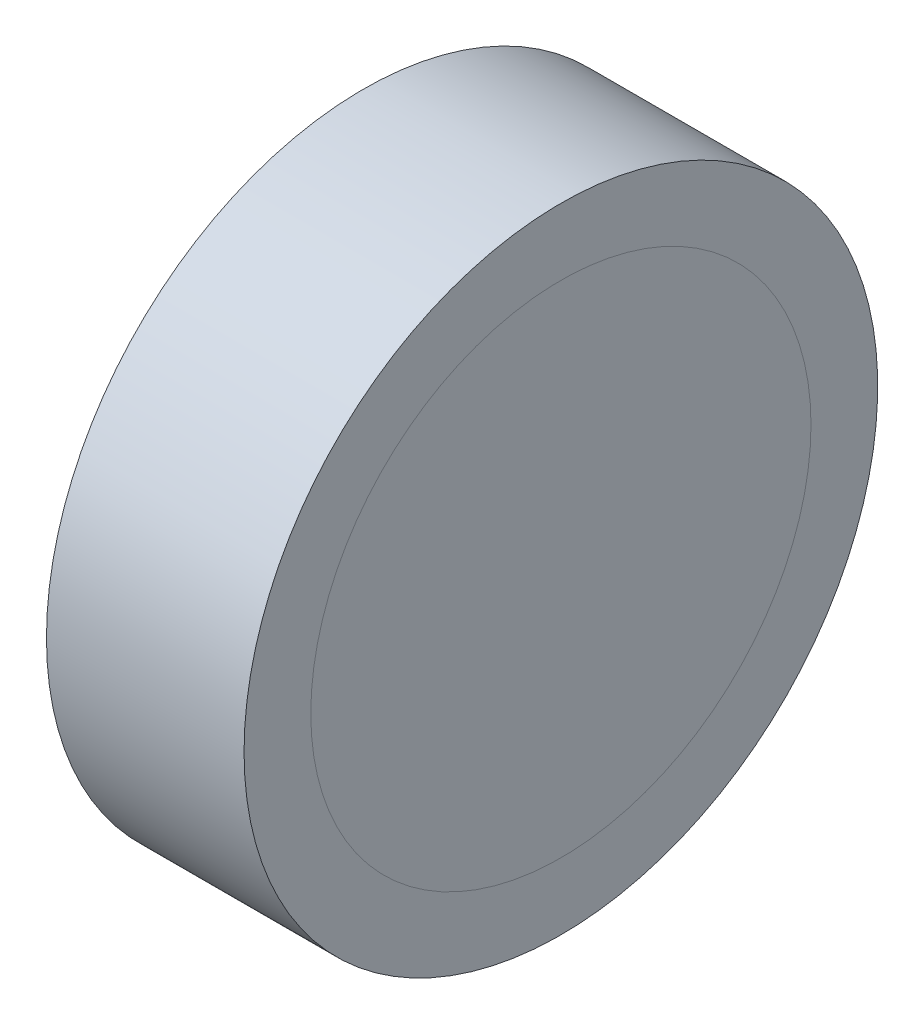
ISO-10303-21;
HEADER;
FILE_DESCRIPTION(('STEP AP214'),'2;1');
FILE_NAME('part.step','',(''),(''),'','','');
FILE_SCHEMA(('AUTOMOTIVE_DESIGN { 1 0 10303 214 1 1 1 1 }'));
ENDSEC;
DATA;
#1=APPLICATION_CONTEXT('core data for automotive mechanical design processes');
#2=APPLICATION_PROTOCOL_DEFINITION('international standard','automotive_design',2000,#1);
#3=PRODUCT_CONTEXT('',#1,'mechanical');
#4=PRODUCT('Part','Part','',(#3));
#5=PRODUCT_RELATED_PRODUCT_CATEGORY('part','',(#4));
#6=PRODUCT_DEFINITION_FORMATION('','',#4);
#7=PRODUCT_DEFINITION_CONTEXT('part definition',#1,'design');
#8=PRODUCT_DEFINITION('design','',#6,#7);
#9=PRODUCT_DEFINITION_SHAPE('','',#8);
#10=(LENGTH_UNIT() NAMED_UNIT(*) SI_UNIT(.MILLI.,.METRE.));
#11=(NAMED_UNIT(*) PLANE_ANGLE_UNIT() SI_UNIT($,.RADIAN.));
#12=(NAMED_UNIT(*) SI_UNIT($,.STERADIAN.) SOLID_ANGLE_UNIT());
#13=UNCERTAINTY_MEASURE_WITH_UNIT(LENGTH_MEASURE(1.E-05),#10,'distance_accuracy_value','');
#14=(GEOMETRIC_REPRESENTATION_CONTEXT(3) GLOBAL_UNCERTAINTY_ASSIGNED_CONTEXT((#13)) GLOBAL_UNIT_ASSIGNED_CONTEXT((#10,
#11,#12)) REPRESENTATION_CONTEXT('',''));
#15=CARTESIAN_POINT('',(0.,0.,0.));
#16=DIRECTION('',(0.,0.,1.));
#17=DIRECTION('',(1.,0.,0.));
#18=AXIS2_PLACEMENT_3D('',#15,#16,#17);
#19=CARTESIAN_POINT('',(301.404713074135,3.33791972254807E-12,0.));
#20=DIRECTION('',(1.,0.,0.));
#21=DIRECTION('',(0.,0.,-1.));
#22=AXIS2_PLACEMENT_3D('',#19,#20,#21);
#23=PLANE('',#22);
#24=CARTESIAN_POINT('',(301.404713074135,62.874237467185,0.));
#25=DIRECTION('',(-1.,0.,0.));
#26=DIRECTION('',(0.,0.,1.));
#27=AXIS2_PLACEMENT_3D('',#24,#25,#26);
#28=CIRCLE('',#27,10.025);
#29=CARTESIAN_POINT('',(301.404713074135,62.874237467185,10.025));
#30=VERTEX_POINT('',#29);
#31=EDGE_CURVE('E50',#30,#30,#28,.T.);
#32=ORIENTED_EDGE('',*,*,#31,.T.);
#33=EDGE_LOOP('',(#32));
#34=FACE_BOUND('',#33,.T.);
#35=ADVANCED_FACE('F44',(#34),#23,.F.);
#36=CARTESIAN_POINT('',(302.404713074135,0.,0.));
#37=DIRECTION('',(1.,0.,0.));
#38=DIRECTION('',(0.,0.,-1.));
#39=AXIS2_PLACEMENT_3D('',#36,#37,#38);
#40=PLANE('',#39);
#41=CARTESIAN_POINT('',(302.404713074135,62.874237467185,0.));
#42=DIRECTION('',(-1.,0.,0.));
#43=DIRECTION('',(0.,0.,1.));
#44=AXIS2_PLACEMENT_3D('',#41,#42,#43);
#45=CIRCLE('',#44,10.025);
#46=CARTESIAN_POINT('',(302.404713074135,62.874237467185,10.025));
#47=VERTEX_POINT('',#46);
#48=EDGE_CURVE('E11',#47,#47,#45,.T.);
#49=ORIENTED_EDGE('',*,*,#48,.F.);
#50=EDGE_LOOP('',(#49));
#51=FACE_BOUND('',#50,.T.);
#52=ADVANCED_FACE('F59',(#51),#40,.T.);
#53=CARTESIAN_POINT('',(286.622526245198,62.874237467185,0.));
#54=DIRECTION('',(-1.,0.,0.));
#55=DIRECTION('',(0.,0.,1.));
#56=AXIS2_PLACEMENT_3D('',#53,#54,#55);
#57=CYLINDRICAL_SURFACE('',#56,10.025);
#58=ORIENTED_EDGE('',*,*,#48,.T.);
#59=EDGE_LOOP('',(#58));
#60=FACE_BOUND('',#59,.T.);
#61=ORIENTED_EDGE('',*,*,#31,.F.);
#62=EDGE_LOOP('',(#61));
#63=FACE_BOUND('',#62,.T.);
#64=ADVANCED_FACE('F57',(#60,#63),#57,.T.);
#65=CLOSED_SHELL('',(#35,#52,#64));
#66=MANIFOLD_SOLID_BREP('B2',#65);
#67=CARTESIAN_POINT('',(294.484713074135,0.,0.));
#68=DIRECTION('',(1.,0.,0.));
#69=DIRECTION('',(0.,0.,-1.));
#70=AXIS2_PLACEMENT_3D('',#67,#68,#69);
#71=PLANE('',#70);
#72=CARTESIAN_POINT('',(294.484713074135,62.874237467185,0.));
#73=DIRECTION('',(-1.,0.,0.));
#74=DIRECTION('',(0.,0.,1.));
#75=AXIS2_PLACEMENT_3D('',#72,#73,#74);
#76=CIRCLE('',#75,10.025);
#77=CARTESIAN_POINT('',(294.484713074135,62.874237467185,10.025));
#78=VERTEX_POINT('',#77);
#79=EDGE_CURVE('E98',#78,#78,#76,.T.);
#80=ORIENTED_EDGE('',*,*,#79,.T.);
#81=EDGE_LOOP('',(#80));
#82=FACE_BOUND('',#81,.T.);
#83=ADVANCED_FACE('F92',(#82),#71,.F.);
#84=CARTESIAN_POINT('',(295.484713074135,2.45426881705483E-12,0.));
#85=DIRECTION('',(1.,0.,0.));
#86=DIRECTION('',(0.,0.,-1.));
#87=AXIS2_PLACEMENT_3D('',#84,#85,#86);
#88=PLANE('',#87);
#89=CARTESIAN_POINT('',(295.484713074135,62.874237467185,0.));
#90=DIRECTION('',(-1.,0.,0.));
#91=DIRECTION('',(0.,0.,1.));
#92=AXIS2_PLACEMENT_3D('',#89,#90,#91);
#93=CIRCLE('',#92,10.025);
#94=CARTESIAN_POINT('',(295.484713074135,62.874237467185,10.025));
#95=VERTEX_POINT('',#94);
#96=EDGE_CURVE('E43',#95,#95,#93,.T.);
#97=ORIENTED_EDGE('',*,*,#96,.F.);
#98=EDGE_LOOP('',(#97));
#99=FACE_BOUND('',#98,.T.);
#100=ADVANCED_FACE('F107',(#99),#88,.T.);
#101=CARTESIAN_POINT('',(286.622526245198,62.874237467185,0.));
#102=DIRECTION('',(-1.,0.,0.));
#103=DIRECTION('',(0.,0.,1.));
#104=AXIS2_PLACEMENT_3D('',#101,#102,#103);
#105=CYLINDRICAL_SURFACE('',#104,10.025);
#106=ORIENTED_EDGE('',*,*,#96,.T.);
#107=EDGE_LOOP('',(#106));
#108=FACE_BOUND('',#107,.T.);
#109=ORIENTED_EDGE('',*,*,#79,.F.);
#110=EDGE_LOOP('',(#109));
#111=FACE_BOUND('',#110,.T.);
#112=ADVANCED_FACE('F105',(#108,#111),#105,.T.);
#113=CLOSED_SHELL('',(#83,#100,#112));
#114=MANIFOLD_SOLID_BREP('B6',#113);
#115=CARTESIAN_POINT('',(295.484713074135,2.45426881705483E-12,0.));
#116=DIRECTION('',(1.,0.,0.));
#117=DIRECTION('',(0.,0.,-1.));
#118=AXIS2_PLACEMENT_3D('',#115,#116,#117);
#119=PLANE('',#118);
#120=CARTESIAN_POINT('',(295.484713074135,62.874237467185,0.));
#121=DIRECTION('',(-1.,0.,0.));
#122=DIRECTION('',(0.,0.,1.));
#123=AXIS2_PLACEMENT_3D('',#120,#121,#122);
#124=CIRCLE('',#123,7.55);
#125=CARTESIAN_POINT('',(295.484713074135,62.874237467185,7.55));
#126=VERTEX_POINT('',#125);
#127=EDGE_CURVE('E91',#126,#126,#124,.T.);
#128=ORIENTED_EDGE('',*,*,#127,.F.);
#129=EDGE_LOOP('',(#128));
#130=FACE_BOUND('',#129,.T.);
#131=CARTESIAN_POINT('',(295.484713074135,62.874237467185,0.));
#132=DIRECTION('',(-1.,0.,0.));
#133=DIRECTION('',(0.,0.,1.));
#134=AXIS2_PLACEMENT_3D('',#131,#132,#133);
#135=CIRCLE('',#134,10.025);
#136=CARTESIAN_POINT('',(295.484713074135,62.874237467185,10.025));
#137=VERTEX_POINT('',#136);
#138=EDGE_CURVE('E161',#137,#137,#135,.T.);
#139=ORIENTED_EDGE('',*,*,#138,.T.);
#140=EDGE_LOOP('',(#139));
#141=FACE_BOUND('',#140,.T.);
#142=ADVANCED_FACE('F133',(#130,#141),#119,.F.);
#143=CARTESIAN_POINT('',(286.622526245198,62.874237467185,0.));
#144=DIRECTION('',(-1.,0.,0.));
#145=DIRECTION('',(0.,0.,1.));
#146=AXIS2_PLACEMENT_3D('',#143,#144,#145);
#147=CYLINDRICAL_SURFACE('',#146,7.55);
#148=CARTESIAN_POINT('',(301.404713074135,62.874237467185,0.));
#149=DIRECTION('',(-1.,0.,0.));
#150=DIRECTION('',(0.,0.,1.));
#151=AXIS2_PLACEMENT_3D('',#148,#149,#150);
#152=CIRCLE('',#151,7.55);
#153=CARTESIAN_POINT('',(301.404713074135,62.874237467185,7.55));
#154=VERTEX_POINT('',#153);
#155=EDGE_CURVE('E139',#154,#154,#152,.T.);
#156=ORIENTED_EDGE('',*,*,#155,.F.);
#157=EDGE_LOOP('',(#156));
#158=FACE_BOUND('',#157,.T.);
#159=ORIENTED_EDGE('',*,*,#127,.T.);
#160=EDGE_LOOP('',(#159));
#161=FACE_BOUND('',#160,.T.);
#162=ADVANCED_FACE('F190',(#158,#161),#147,.F.);
#163=CARTESIAN_POINT('',(301.404713074135,3.33791972254807E-12,0.));
#164=DIRECTION('',(1.,0.,0.));
#165=DIRECTION('',(0.,0.,-1.));
#166=AXIS2_PLACEMENT_3D('',#163,#164,#165);
#167=PLANE('',#166);
#168=ORIENTED_EDGE('',*,*,#155,.T.);
#169=EDGE_LOOP('',(#168));
#170=FACE_BOUND('',#169,.T.);
#171=CARTESIAN_POINT('',(301.404713074135,62.874237467185,0.));
#172=DIRECTION('',(-1.,0.,0.));
#173=DIRECTION('',(0.,0.,1.));
#174=AXIS2_PLACEMENT_3D('',#171,#172,#173);
#175=CIRCLE('',#174,10.025);
#176=CARTESIAN_POINT('',(301.404713074135,62.874237467185,10.025));
#177=VERTEX_POINT('',#176);
#178=EDGE_CURVE('E143',#177,#177,#175,.T.);
#179=ORIENTED_EDGE('',*,*,#178,.F.);
#180=EDGE_LOOP('',(#179));
#181=FACE_BOUND('',#180,.T.);
#182=ADVANCED_FACE('F195',(#170,#181),#167,.T.);
#183=CARTESIAN_POINT('',(286.622526245198,62.874237467185,0.));
#184=DIRECTION('',(-1.,0.,0.));
#185=DIRECTION('',(0.,0.,1.));
#186=AXIS2_PLACEMENT_3D('',#183,#184,#185);
#187=CYLINDRICAL_SURFACE('',#186,10.025);
#188=CARTESIAN_POINT('',(302.404713074135,62.874237467185,0.));
#189=DIRECTION('',(-1.,0.,0.));
#190=DIRECTION('',(0.,0.,1.));
#191=AXIS2_PLACEMENT_3D('',#188,#189,#190);
#192=CIRCLE('',#191,10.025);
#193=CARTESIAN_POINT('',(302.404713074135,62.874237467185,10.025));
#194=VERTEX_POINT('',#193);
#195=EDGE_CURVE('E147',#194,#194,#192,.T.);
#196=ORIENTED_EDGE('',*,*,#195,.F.);
#197=EDGE_LOOP('',(#196));
#198=FACE_BOUND('',#197,.T.);
#199=ORIENTED_EDGE('',*,*,#178,.T.);
#200=EDGE_LOOP('',(#199));
#201=FACE_BOUND('',#200,.T.);
#202=ADVANCED_FACE('F186',(#198,#201),#187,.F.);
#203=CARTESIAN_POINT('',(302.404713074135,0.,0.));
#204=DIRECTION('',(1.,0.,0.));
#205=DIRECTION('',(0.,0.,-1.));
#206=AXIS2_PLACEMENT_3D('',#203,#204,#205);
#207=PLANE('',#206);
#208=ORIENTED_EDGE('',*,*,#195,.T.);
#209=EDGE_LOOP('',(#208));
#210=FACE_BOUND('',#209,.T.);
#211=CARTESIAN_POINT('',(302.404713074135,62.874237467185,0.));
#212=DIRECTION('',(-1.,0.,0.));
#213=DIRECTION('',(0.,0.,1.));
#214=AXIS2_PLACEMENT_3D('',#211,#212,#213);
#215=CIRCLE('',#214,12.7);
#216=CARTESIAN_POINT('',(302.404713074135,62.874237467185,12.7));
#217=VERTEX_POINT('',#216);
#218=EDGE_CURVE('E152',#217,#217,#215,.T.);
#219=ORIENTED_EDGE('',*,*,#218,.F.);
#220=EDGE_LOOP('',(#219));
#221=FACE_BOUND('',#220,.T.);
#222=ADVANCED_FACE('F180',(#210,#221),#207,.T.);
#223=CARTESIAN_POINT('',(286.622526245198,62.874237467185,0.));
#224=DIRECTION('',(-1.,0.,0.));
#225=DIRECTION('',(0.,0.,1.));
#226=AXIS2_PLACEMENT_3D('',#223,#224,#225);
#227=CYLINDRICAL_SURFACE('',#226,12.7);
#228=ORIENTED_EDGE('',*,*,#218,.T.);
#229=EDGE_LOOP('',(#228));
#230=FACE_BOUND('',#229,.T.);
#231=CARTESIAN_POINT('',(294.484713074135,62.874237467185,0.));
#232=DIRECTION('',(-1.,0.,0.));
#233=DIRECTION('',(0.,0.,1.));
#234=AXIS2_PLACEMENT_3D('',#231,#232,#233);
#235=CIRCLE('',#234,12.7);
#236=CARTESIAN_POINT('',(294.484713074135,62.874237467185,12.7));
#237=VERTEX_POINT('',#236);
#238=EDGE_CURVE('E155',#237,#237,#235,.T.);
#239=ORIENTED_EDGE('',*,*,#238,.F.);
#240=EDGE_LOOP('',(#239));
#241=FACE_BOUND('',#240,.T.);
#242=ADVANCED_FACE('F175',(#230,#241),#227,.T.);
#243=CARTESIAN_POINT('',(294.484713074135,0.,0.));
#244=DIRECTION('',(1.,0.,0.));
#245=DIRECTION('',(0.,0.,-1.));
#246=AXIS2_PLACEMENT_3D('',#243,#244,#245);
#247=PLANE('',#246);
#248=CARTESIAN_POINT('',(294.484713074135,62.874237467185,0.));
#249=DIRECTION('',(-1.,0.,0.));
#250=DIRECTION('',(0.,0.,1.));
#251=AXIS2_PLACEMENT_3D('',#248,#249,#250);
#252=CIRCLE('',#251,10.025);
#253=CARTESIAN_POINT('',(294.484713074135,62.874237467185,10.025));
#254=VERTEX_POINT('',#253);
#255=EDGE_CURVE('E158',#254,#254,#252,.T.);
#256=ORIENTED_EDGE('',*,*,#255,.F.);
#257=EDGE_LOOP('',(#256));
#258=FACE_BOUND('',#257,.T.);
#259=ORIENTED_EDGE('',*,*,#238,.T.);
#260=EDGE_LOOP('',(#259));
#261=FACE_BOUND('',#260,.T.);
#262=ADVANCED_FACE('F169',(#258,#261),#247,.F.);
#263=CARTESIAN_POINT('',(286.622526245198,62.874237467185,0.));
#264=DIRECTION('',(-1.,0.,0.));
#265=DIRECTION('',(0.,0.,1.));
#266=AXIS2_PLACEMENT_3D('',#263,#264,#265);
#267=CYLINDRICAL_SURFACE('',#266,10.025);
#268=ORIENTED_EDGE('',*,*,#138,.F.);
#269=EDGE_LOOP('',(#268));
#270=FACE_BOUND('',#269,.T.);
#271=ORIENTED_EDGE('',*,*,#255,.T.);
#272=EDGE_LOOP('',(#271));
#273=FACE_BOUND('',#272,.T.);
#274=ADVANCED_FACE('F166',(#270,#273),#267,.F.);
#275=CLOSED_SHELL('',(#142,#162,#182,#202,#222,#242,#262,#274));
#276=MANIFOLD_SOLID_BREP('B38',#275);
#277=ADVANCED_BREP_SHAPE_REPRESENTATION('',(#18,#66,#114,#276),#14);
#278=SHAPE_DEFINITION_REPRESENTATION(#9,#277);
ENDSEC;
END-ISO-10303-21;
